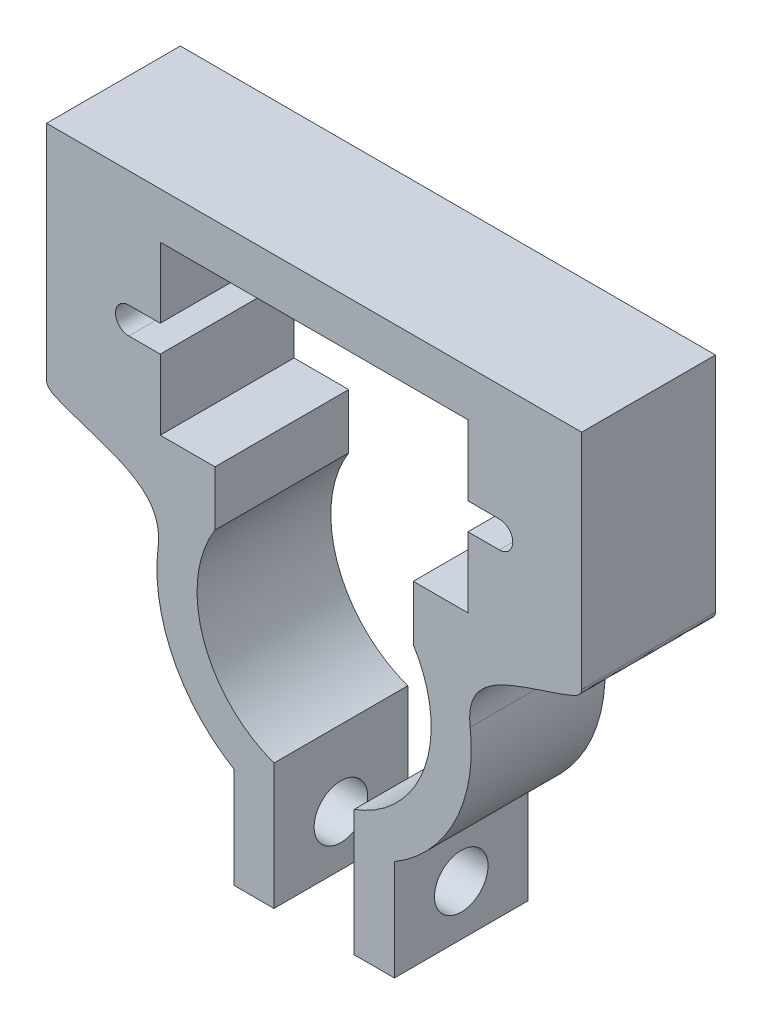
ISO-10303-21;
HEADER;
FILE_DESCRIPTION(('STEP AP214'),'2;1');
FILE_NAME('part.step','',(''),(''),'','','');
FILE_SCHEMA(('AUTOMOTIVE_DESIGN { 1 0 10303 214 1 1 1 1 }'));
ENDSEC;
DATA;
#1=APPLICATION_CONTEXT('core data for automotive mechanical design processes');
#2=APPLICATION_PROTOCOL_DEFINITION('international standard','automotive_design',2000,#1);
#3=PRODUCT_CONTEXT('',#1,'mechanical');
#4=PRODUCT('Part','Part','',(#3));
#5=PRODUCT_RELATED_PRODUCT_CATEGORY('part','',(#4));
#6=PRODUCT_DEFINITION_FORMATION('','',#4);
#7=PRODUCT_DEFINITION_CONTEXT('part definition',#1,'design');
#8=PRODUCT_DEFINITION('design','',#6,#7);
#9=PRODUCT_DEFINITION_SHAPE('','',#8);
#10=(LENGTH_UNIT() NAMED_UNIT(*) SI_UNIT(.MILLI.,.METRE.));
#11=(NAMED_UNIT(*) PLANE_ANGLE_UNIT() SI_UNIT($,.RADIAN.));
#12=(NAMED_UNIT(*) SI_UNIT($,.STERADIAN.) SOLID_ANGLE_UNIT());
#13=UNCERTAINTY_MEASURE_WITH_UNIT(LENGTH_MEASURE(1.E-05),#10,'distance_accuracy_value','');
#14=(GEOMETRIC_REPRESENTATION_CONTEXT(3) GLOBAL_UNCERTAINTY_ASSIGNED_CONTEXT((#13)) GLOBAL_UNIT_ASSIGNED_CONTEXT((#10,
#11,#12)) REPRESENTATION_CONTEXT('',''));
#15=CARTESIAN_POINT('',(0.,0.,0.));
#16=DIRECTION('',(0.,0.,1.));
#17=DIRECTION('',(1.,0.,0.));
#18=AXIS2_PLACEMENT_3D('',#15,#16,#17);
#19=CARTESIAN_POINT('',(-11.5,21.25,10.));
#20=DIRECTION('',(-1.,0.,0.));
#21=DIRECTION('',(0.,0.,1.));
#22=AXIS2_PLACEMENT_3D('',#19,#20,#21);
#23=PLANE('',#22);
#24=DIRECTION('',(0.,1.,0.));
#25=VECTOR('',#24,1.);
#26=CARTESIAN_POINT('',(-11.5,21.25,0.));
#27=LINE('',#26,#25);
#28=CARTESIAN_POINT('',(-11.5,16.,0.));
#29=VERTEX_POINT('',#28);
#30=CARTESIAN_POINT('',(-11.5,21.25,0.));
#31=VERTEX_POINT('',#30);
#32=EDGE_CURVE('E264',#29,#31,#27,.T.);
#33=ORIENTED_EDGE('',*,*,#32,.T.);
#34=DIRECTION('',(0.,0.,-1.));
#35=VECTOR('',#34,1.);
#36=CARTESIAN_POINT('',(-11.5,21.25,10.));
#37=LINE('',#36,#35);
#38=CARTESIAN_POINT('',(-11.5,21.25,10.));
#39=VERTEX_POINT('',#38);
#40=EDGE_CURVE('E11',#39,#31,#37,.T.);
#41=ORIENTED_EDGE('',*,*,#40,.F.);
#42=DIRECTION('',(0.,1.,0.));
#43=VECTOR('',#42,1.);
#44=CARTESIAN_POINT('',(-11.5,21.25,10.));
#45=LINE('',#44,#43);
#46=CARTESIAN_POINT('',(-11.5,16.,10.));
#47=VERTEX_POINT('',#46);
#48=EDGE_CURVE('E333',#47,#39,#45,.T.);
#49=ORIENTED_EDGE('',*,*,#48,.F.);
#50=DIRECTION('',(0.,0.,-1.));
#51=VECTOR('',#50,1.);
#52=CARTESIAN_POINT('',(-11.5,16.,10.));
#53=LINE('',#52,#51);
#54=EDGE_CURVE('E260',#47,#29,#53,.T.);
#55=ORIENTED_EDGE('',*,*,#54,.T.);
#56=EDGE_LOOP('',(#33,#41,#49,#55));
#57=FACE_BOUND('',#56,.T.);
#58=ADVANCED_FACE('F35',(#57),#23,.F.);
#59=CARTESIAN_POINT('',(11.5,21.25,10.));
#60=DIRECTION('',(0.,1.,0.));
#61=DIRECTION('',(0.,0.,1.));
#62=AXIS2_PLACEMENT_3D('',#59,#60,#61);
#63=PLANE('',#62);
#64=DIRECTION('',(1.,0.,0.));
#65=VECTOR('',#64,1.);
#66=CARTESIAN_POINT('',(11.5,21.25,0.));
#67=LINE('',#66,#65);
#68=CARTESIAN_POINT('',(11.5,21.25,0.));
#69=VERTEX_POINT('',#68);
#70=EDGE_CURVE('E267',#31,#69,#67,.T.);
#71=ORIENTED_EDGE('',*,*,#70,.T.);
#72=DIRECTION('',(0.,0.,-1.));
#73=VECTOR('',#72,1.);
#74=CARTESIAN_POINT('',(11.5,21.25,10.));
#75=LINE('',#74,#73);
#76=CARTESIAN_POINT('',(11.5,21.25,10.));
#77=VERTEX_POINT('',#76);
#78=EDGE_CURVE('E44',#77,#69,#75,.T.);
#79=ORIENTED_EDGE('',*,*,#78,.F.);
#80=DIRECTION('',(1.,0.,0.));
#81=VECTOR('',#80,1.);
#82=CARTESIAN_POINT('',(11.5,21.25,10.));
#83=LINE('',#82,#81);
#84=EDGE_CURVE('E161',#39,#77,#83,.T.);
#85=ORIENTED_EDGE('',*,*,#84,.F.);
#86=ORIENTED_EDGE('',*,*,#40,.T.);
#87=EDGE_LOOP('',(#71,#79,#85,#86));
#88=FACE_BOUND('',#87,.T.);
#89=ADVANCED_FACE('F514',(#88),#63,.F.);
#90=CARTESIAN_POINT('',(11.5,21.25,10.));
#91=DIRECTION('',(1.,0.,0.));
#92=DIRECTION('',(0.,0.,-1.));
#93=AXIS2_PLACEMENT_3D('',#90,#91,#92);
#94=PLANE('',#93);
#95=DIRECTION('',(0.,-1.,0.));
#96=VECTOR('',#95,1.);
#97=CARTESIAN_POINT('',(11.5,21.25,0.));
#98=LINE('',#97,#96);
#99=CARTESIAN_POINT('',(11.5,16.,0.));
#100=VERTEX_POINT('',#99);
#101=EDGE_CURVE('E270',#69,#100,#98,.T.);
#102=ORIENTED_EDGE('',*,*,#101,.T.);
#103=DIRECTION('',(0.,0.,-1.));
#104=VECTOR('',#103,1.);
#105=CARTESIAN_POINT('',(11.5,16.,10.));
#106=LINE('',#105,#104);
#107=CARTESIAN_POINT('',(11.5,16.,10.));
#108=VERTEX_POINT('',#107);
#109=EDGE_CURVE('E406',#108,#100,#106,.T.);
#110=ORIENTED_EDGE('',*,*,#109,.F.);
#111=DIRECTION('',(0.,-1.,0.));
#112=VECTOR('',#111,1.);
#113=CARTESIAN_POINT('',(11.5,21.25,10.));
#114=LINE('',#113,#112);
#115=EDGE_CURVE('E415',#77,#108,#114,.T.);
#116=ORIENTED_EDGE('',*,*,#115,.F.);
#117=ORIENTED_EDGE('',*,*,#78,.T.);
#118=EDGE_LOOP('',(#102,#110,#116,#117));
#119=FACE_BOUND('',#118,.T.);
#120=ADVANCED_FACE('F413',(#119),#94,.F.);
#121=CARTESIAN_POINT('',(13.85,16.,10.));
#122=DIRECTION('',(0.,1.,0.));
#123=DIRECTION('',(0.,0.,1.));
#124=AXIS2_PLACEMENT_3D('',#121,#122,#123);
#125=PLANE('',#124);
#126=DIRECTION('',(1.,0.,0.));
#127=VECTOR('',#126,1.);
#128=CARTESIAN_POINT('',(13.85,16.,0.));
#129=LINE('',#128,#127);
#130=CARTESIAN_POINT('',(13.85,16.,0.));
#131=VERTEX_POINT('',#130);
#132=EDGE_CURVE('E272',#100,#131,#129,.T.);
#133=ORIENTED_EDGE('',*,*,#132,.T.);
#134=DIRECTION('',(0.,0.,-1.));
#135=VECTOR('',#134,1.);
#136=CARTESIAN_POINT('',(13.85,16.,10.));
#137=LINE('',#136,#135);
#138=CARTESIAN_POINT('',(13.85,16.,10.));
#139=VERTEX_POINT('',#138);
#140=EDGE_CURVE('E403',#139,#131,#137,.T.);
#141=ORIENTED_EDGE('',*,*,#140,.F.);
#142=DIRECTION('',(1.,0.,0.));
#143=VECTOR('',#142,1.);
#144=CARTESIAN_POINT('',(13.85,16.,10.));
#145=LINE('',#144,#143);
#146=EDGE_CURVE('E433',#108,#139,#145,.T.);
#147=ORIENTED_EDGE('',*,*,#146,.F.);
#148=ORIENTED_EDGE('',*,*,#109,.T.);
#149=EDGE_LOOP('',(#133,#141,#147,#148));
#150=FACE_BOUND('',#149,.T.);
#151=ADVANCED_FACE('F424',(#150),#125,.F.);
#152=CARTESIAN_POINT('',(13.85,15.,10.));
#153=DIRECTION('',(0.,0.,-1.));
#154=DIRECTION('',(-1.,0.,0.));
#155=AXIS2_PLACEMENT_3D('',#152,#153,#154);
#156=CYLINDRICAL_SURFACE('',#155,1.);
#157=CARTESIAN_POINT('',(13.85,15.,0.));
#158=DIRECTION('',(0.,0.,-1.));
#159=DIRECTION('',(-1.,0.,0.));
#160=AXIS2_PLACEMENT_3D('',#157,#158,#159);
#161=CIRCLE('',#160,1.);
#162=CARTESIAN_POINT('',(13.85,14.,0.));
#163=VERTEX_POINT('',#162);
#164=EDGE_CURVE('E274',#131,#163,#161,.T.);
#165=ORIENTED_EDGE('',*,*,#164,.T.);
#166=DIRECTION('',(0.,0.,-1.));
#167=VECTOR('',#166,1.);
#168=CARTESIAN_POINT('',(13.85,14.,10.));
#169=LINE('',#168,#167);
#170=CARTESIAN_POINT('',(13.85,14.,10.));
#171=VERTEX_POINT('',#170);
#172=EDGE_CURVE('E400',#171,#163,#169,.T.);
#173=ORIENTED_EDGE('',*,*,#172,.F.);
#174=CARTESIAN_POINT('',(13.85,15.,10.));
#175=DIRECTION('',(0.,0.,-1.));
#176=DIRECTION('',(-1.,0.,0.));
#177=AXIS2_PLACEMENT_3D('',#174,#175,#176);
#178=CIRCLE('',#177,1.);
#179=EDGE_CURVE('E430',#139,#171,#178,.T.);
#180=ORIENTED_EDGE('',*,*,#179,.F.);
#181=ORIENTED_EDGE('',*,*,#140,.T.);
#182=EDGE_LOOP('',(#165,#173,#180,#181));
#183=FACE_BOUND('',#182,.T.);
#184=ADVANCED_FACE('F428',(#183),#156,.F.);
#185=CARTESIAN_POINT('',(13.85,14.,10.));
#186=DIRECTION('',(0.,-1.,0.));
#187=DIRECTION('',(0.,0.,-1.));
#188=AXIS2_PLACEMENT_3D('',#185,#186,#187);
#189=PLANE('',#188);
#190=DIRECTION('',(-1.,0.,0.));
#191=VECTOR('',#190,1.);
#192=CARTESIAN_POINT('',(13.85,14.,0.));
#193=LINE('',#192,#191);
#194=CARTESIAN_POINT('',(11.5,14.,0.));
#195=VERTEX_POINT('',#194);
#196=EDGE_CURVE('E276',#163,#195,#193,.T.);
#197=ORIENTED_EDGE('',*,*,#196,.T.);
#198=DIRECTION('',(0.,0.,-1.));
#199=VECTOR('',#198,1.);
#200=CARTESIAN_POINT('',(11.5,14.,10.));
#201=LINE('',#200,#199);
#202=CARTESIAN_POINT('',(11.5,14.,10.));
#203=VERTEX_POINT('',#202);
#204=EDGE_CURVE('E397',#203,#195,#201,.T.);
#205=ORIENTED_EDGE('',*,*,#204,.F.);
#206=DIRECTION('',(-1.,0.,0.));
#207=VECTOR('',#206,1.);
#208=CARTESIAN_POINT('',(13.85,14.,10.));
#209=LINE('',#208,#207);
#210=EDGE_CURVE('E432',#171,#203,#209,.T.);
#211=ORIENTED_EDGE('',*,*,#210,.F.);
#212=ORIENTED_EDGE('',*,*,#172,.T.);
#213=EDGE_LOOP('',(#197,#205,#211,#212));
#214=FACE_BOUND('',#213,.T.);
#215=ADVANCED_FACE('F504',(#214),#189,.F.);
#216=CARTESIAN_POINT('',(11.5,14.,10.));
#217=DIRECTION('',(1.,0.,0.));
#218=DIRECTION('',(0.,0.,-1.));
#219=AXIS2_PLACEMENT_3D('',#216,#217,#218);
#220=PLANE('',#219);
#221=DIRECTION('',(0.,-1.,0.));
#222=VECTOR('',#221,1.);
#223=CARTESIAN_POINT('',(11.5,14.,0.));
#224=LINE('',#223,#222);
#225=CARTESIAN_POINT('',(11.5,8.75,0.));
#226=VERTEX_POINT('',#225);
#227=EDGE_CURVE('E278',#195,#226,#224,.T.);
#228=ORIENTED_EDGE('',*,*,#227,.T.);
#229=DIRECTION('',(0.,0.,-1.));
#230=VECTOR('',#229,1.);
#231=CARTESIAN_POINT('',(11.5,8.75,10.));
#232=LINE('',#231,#230);
#233=CARTESIAN_POINT('',(11.5,8.75,10.));
#234=VERTEX_POINT('',#233);
#235=EDGE_CURVE('E394',#234,#226,#232,.T.);
#236=ORIENTED_EDGE('',*,*,#235,.F.);
#237=DIRECTION('',(0.,-1.,0.));
#238=VECTOR('',#237,1.);
#239=CARTESIAN_POINT('',(11.5,14.,10.));
#240=LINE('',#239,#238);
#241=EDGE_CURVE('E435',#203,#234,#240,.T.);
#242=ORIENTED_EDGE('',*,*,#241,.F.);
#243=ORIENTED_EDGE('',*,*,#204,.T.);
#244=EDGE_LOOP('',(#228,#236,#242,#243));
#245=FACE_BOUND('',#244,.T.);
#246=ADVANCED_FACE('F500',(#245),#220,.F.);
#247=CARTESIAN_POINT('',(11.5,8.75,10.));
#248=DIRECTION('',(0.,-1.,0.));
#249=DIRECTION('',(0.,0.,-1.));
#250=AXIS2_PLACEMENT_3D('',#247,#248,#249);
#251=PLANE('',#250);
#252=DIRECTION('',(-1.,0.,0.));
#253=VECTOR('',#252,1.);
#254=CARTESIAN_POINT('',(11.5,8.75,0.));
#255=LINE('',#254,#253);
#256=CARTESIAN_POINT('',(7.41110178363122,8.75,0.));
#257=VERTEX_POINT('',#256);
#258=EDGE_CURVE('E280',#226,#257,#255,.T.);
#259=ORIENTED_EDGE('',*,*,#258,.T.);
#260=DIRECTION('',(0.,0.,-1.));
#261=VECTOR('',#260,1.);
#262=CARTESIAN_POINT('',(7.41110178363122,8.75,10.));
#263=LINE('',#262,#261);
#264=CARTESIAN_POINT('',(7.41110178363122,8.75,10.));
#265=VERTEX_POINT('',#264);
#266=EDGE_CURVE('E391',#265,#257,#263,.T.);
#267=ORIENTED_EDGE('',*,*,#266,.F.);
#268=DIRECTION('',(-1.,0.,0.));
#269=VECTOR('',#268,1.);
#270=CARTESIAN_POINT('',(11.5,8.75,10.));
#271=LINE('',#270,#269);
#272=EDGE_CURVE('E441',#234,#265,#271,.T.);
#273=ORIENTED_EDGE('',*,*,#272,.F.);
#274=ORIENTED_EDGE('',*,*,#235,.T.);
#275=EDGE_LOOP('',(#259,#267,#273,#274));
#276=FACE_BOUND('',#275,.T.);
#277=ADVANCED_FACE('F496',(#276),#251,.F.);
#278=CARTESIAN_POINT('',(7.41110178363122,8.75,10.));
#279=DIRECTION('',(1.,0.,0.));
#280=DIRECTION('',(0.,0.,-1.));
#281=AXIS2_PLACEMENT_3D('',#278,#279,#280);
#282=PLANE('',#281);
#283=DIRECTION('',(0.,-1.,0.));
#284=VECTOR('',#283,1.);
#285=CARTESIAN_POINT('',(7.41110178363122,8.75,0.));
#286=LINE('',#285,#284);
#287=CARTESIAN_POINT('',(7.41110178363122,4.65167393017376,0.));
#288=VERTEX_POINT('',#287);
#289=EDGE_CURVE('E282',#257,#288,#286,.T.);
#290=ORIENTED_EDGE('',*,*,#289,.T.);
#291=DIRECTION('',(0.,0.,-1.));
#292=VECTOR('',#291,1.);
#293=CARTESIAN_POINT('',(7.41110178363122,4.65167393017376,10.));
#294=LINE('',#293,#292);
#295=CARTESIAN_POINT('',(7.41110178363122,4.65167393017376,10.));
#296=VERTEX_POINT('',#295);
#297=EDGE_CURVE('E388',#296,#288,#294,.T.);
#298=ORIENTED_EDGE('',*,*,#297,.F.);
#299=DIRECTION('',(0.,-1.,0.));
#300=VECTOR('',#299,1.);
#301=CARTESIAN_POINT('',(7.41110178363122,8.75,10.));
#302=LINE('',#301,#300);
#303=EDGE_CURVE('E443',#265,#296,#302,.T.);
#304=ORIENTED_EDGE('',*,*,#303,.F.);
#305=ORIENTED_EDGE('',*,*,#266,.T.);
#306=EDGE_LOOP('',(#290,#298,#304,#305));
#307=FACE_BOUND('',#306,.T.);
#308=ADVANCED_FACE('F492',(#307),#282,.F.);
#309=CARTESIAN_POINT('',(0.,0.,10.));
#310=DIRECTION('',(0.,0.,-1.));
#311=DIRECTION('',(-1.,0.,0.));
#312=AXIS2_PLACEMENT_3D('',#309,#310,#311);
#313=CYLINDRICAL_SURFACE('',#312,8.75);
#314=CARTESIAN_POINT('',(0.,0.,0.));
#315=DIRECTION('',(0.,0.,-1.));
#316=DIRECTION('',(1.,0.,0.));
#317=AXIS2_PLACEMENT_3D('',#314,#315,#316);
#318=CIRCLE('',#317,8.75);
#319=CARTESIAN_POINT('',(3.,-8.2196411113868,0.));
#320=VERTEX_POINT('',#319);
#321=EDGE_CURVE('E284',#288,#320,#318,.T.);
#322=ORIENTED_EDGE('',*,*,#321,.T.);
#323=DIRECTION('',(0.,0.,-1.));
#324=VECTOR('',#323,1.);
#325=CARTESIAN_POINT('',(3.,-8.2196411113868,10.));
#326=LINE('',#325,#324);
#327=CARTESIAN_POINT('',(3.,-8.2196411113868,10.));
#328=VERTEX_POINT('',#327);
#329=EDGE_CURVE('E385',#328,#320,#326,.T.);
#330=ORIENTED_EDGE('',*,*,#329,.F.);
#331=CARTESIAN_POINT('',(0.,0.,10.));
#332=DIRECTION('',(0.,0.,-1.));
#333=DIRECTION('',(1.,0.,0.));
#334=AXIS2_PLACEMENT_3D('',#331,#332,#333);
#335=CIRCLE('',#334,8.75);
#336=EDGE_CURVE('E445',#296,#328,#335,.T.);
#337=ORIENTED_EDGE('',*,*,#336,.F.);
#338=ORIENTED_EDGE('',*,*,#297,.T.);
#339=EDGE_LOOP('',(#322,#330,#337,#338));
#340=FACE_BOUND('',#339,.T.);
#341=ADVANCED_FACE('F488',(#340),#313,.F.);
#342=CARTESIAN_POINT('',(3.,-17.6369966719299,10.));
#343=DIRECTION('',(1.,0.,0.));
#344=DIRECTION('',(0.,0.,-1.));
#345=AXIS2_PLACEMENT_3D('',#342,#343,#344);
#346=PLANE('',#345);
#347=CARTESIAN_POINT('',(3.,-13.8697976737591,5.));
#348=DIRECTION('',(1.,0.,0.));
#349=DIRECTION('',(0.,0.,-1.));
#350=AXIS2_PLACEMENT_3D('',#347,#348,#349);
#351=CIRCLE('',#350,2.);
#352=CARTESIAN_POINT('',(3.,-13.8697976737591,3.));
#353=VERTEX_POINT('',#352);
#354=EDGE_CURVE('E268',#353,#353,#351,.T.);
#355=ORIENTED_EDGE('',*,*,#354,.T.);
#356=EDGE_LOOP('',(#355));
#357=FACE_BOUND('',#356,.T.);
#358=DIRECTION('',(0.,-1.,0.));
#359=VECTOR('',#358,1.);
#360=CARTESIAN_POINT('',(3.,-17.6369966719299,0.));
#361=LINE('',#360,#359);
#362=CARTESIAN_POINT('',(3.,-17.6369966719299,0.));
#363=VERTEX_POINT('',#362);
#364=EDGE_CURVE('E286',#320,#363,#361,.T.);
#365=ORIENTED_EDGE('',*,*,#364,.T.);
#366=DIRECTION('',(0.,0.,-1.));
#367=VECTOR('',#366,1.);
#368=CARTESIAN_POINT('',(3.,-17.6369966719299,10.));
#369=LINE('',#368,#367);
#370=CARTESIAN_POINT('',(3.,-17.6369966719299,10.));
#371=VERTEX_POINT('',#370);
#372=EDGE_CURVE('E382',#371,#363,#369,.T.);
#373=ORIENTED_EDGE('',*,*,#372,.F.);
#374=DIRECTION('',(0.,-1.,0.));
#375=VECTOR('',#374,1.);
#376=CARTESIAN_POINT('',(3.,-17.6369966719299,10.));
#377=LINE('',#376,#375);
#378=EDGE_CURVE('E447',#328,#371,#377,.T.);
#379=ORIENTED_EDGE('',*,*,#378,.F.);
#380=ORIENTED_EDGE('',*,*,#329,.T.);
#381=EDGE_LOOP('',(#365,#373,#379,#380));
#382=FACE_BOUND('',#381,.T.);
#383=ADVANCED_FACE('F484',(#357,#382),#346,.F.);
#384=CARTESIAN_POINT('',(6.,-17.6369966719299,10.));
#385=DIRECTION('',(0.,1.,0.));
#386=DIRECTION('',(0.,0.,1.));
#387=AXIS2_PLACEMENT_3D('',#384,#385,#386);
#388=PLANE('',#387);
#389=DIRECTION('',(1.,0.,0.));
#390=VECTOR('',#389,1.);
#391=CARTESIAN_POINT('',(6.,-17.6369966719299,0.));
#392=LINE('',#391,#390);
#393=CARTESIAN_POINT('',(6.,-17.6369966719299,0.));
#394=VERTEX_POINT('',#393);
#395=EDGE_CURVE('E288',#363,#394,#392,.T.);
#396=ORIENTED_EDGE('',*,*,#395,.T.);
#397=DIRECTION('',(0.,0.,-1.));
#398=VECTOR('',#397,1.);
#399=CARTESIAN_POINT('',(6.,-17.6369966719299,10.));
#400=LINE('',#399,#398);
#401=CARTESIAN_POINT('',(6.,-17.6369966719299,10.));
#402=VERTEX_POINT('',#401);
#403=EDGE_CURVE('E379',#402,#394,#400,.T.);
#404=ORIENTED_EDGE('',*,*,#403,.F.);
#405=DIRECTION('',(1.,0.,0.));
#406=VECTOR('',#405,1.);
#407=CARTESIAN_POINT('',(6.,-17.6369966719299,10.));
#408=LINE('',#407,#406);
#409=EDGE_CURVE('E449',#371,#402,#408,.T.);
#410=ORIENTED_EDGE('',*,*,#409,.F.);
#411=ORIENTED_EDGE('',*,*,#372,.T.);
#412=EDGE_LOOP('',(#396,#404,#410,#411));
#413=FACE_BOUND('',#412,.T.);
#414=ADVANCED_FACE('F480',(#413),#388,.F.);
#415=CARTESIAN_POINT('',(6.,-10.1025986755884,10.));
#416=DIRECTION('',(-1.,0.,0.));
#417=DIRECTION('',(0.,-1.,0.));
#418=AXIS2_PLACEMENT_3D('',#415,#416,#417);
#419=PLANE('',#418);
#420=CARTESIAN_POINT('',(6.,-13.8697976737591,5.));
#421=DIRECTION('',(-1.,0.,0.));
#422=DIRECTION('',(0.,-1.,0.));
#423=AXIS2_PLACEMENT_3D('',#420,#421,#422);
#424=CIRCLE('',#423,2.);
#425=CARTESIAN_POINT('',(6.,-15.8697976737591,5.));
#426=VERTEX_POINT('',#425);
#427=EDGE_CURVE('E876',#426,#426,#424,.T.);
#428=ORIENTED_EDGE('',*,*,#427,.T.);
#429=EDGE_LOOP('',(#428));
#430=FACE_BOUND('',#429,.T.);
#431=DIRECTION('',(0.,1.,0.));
#432=VECTOR('',#431,1.);
#433=CARTESIAN_POINT('',(6.,-10.1025986755884,0.));
#434=LINE('',#433,#432);
#435=CARTESIAN_POINT('',(6.,-10.1025986755884,0.));
#436=VERTEX_POINT('',#435);
#437=EDGE_CURVE('E290',#394,#436,#434,.T.);
#438=ORIENTED_EDGE('',*,*,#437,.T.);
#439=DIRECTION('',(0.,0.,-1.));
#440=VECTOR('',#439,1.);
#441=CARTESIAN_POINT('',(6.,-10.1025986755884,10.));
#442=LINE('',#441,#440);
#443=CARTESIAN_POINT('',(6.,-10.1025986755884,10.));
#444=VERTEX_POINT('',#443);
#445=EDGE_CURVE('E376',#444,#436,#442,.T.);
#446=ORIENTED_EDGE('',*,*,#445,.F.);
#447=DIRECTION('',(0.,1.,0.));
#448=VECTOR('',#447,1.);
#449=CARTESIAN_POINT('',(6.,-10.1025986755884,10.));
#450=LINE('',#449,#448);
#451=EDGE_CURVE('E451',#402,#444,#450,.T.);
#452=ORIENTED_EDGE('',*,*,#451,.F.);
#453=ORIENTED_EDGE('',*,*,#403,.T.);
#454=EDGE_LOOP('',(#438,#446,#452,#453));
#455=FACE_BOUND('',#454,.T.);
#456=ADVANCED_FACE('F476',(#430,#455),#419,.F.);
#457=CARTESIAN_POINT('',(0.,0.,10.));
#458=DIRECTION('',(0.,0.,-1.));
#459=DIRECTION('',(-1.,0.,0.));
#460=AXIS2_PLACEMENT_3D('',#457,#458,#459);
#461=CYLINDRICAL_SURFACE('',#460,11.75);
#462=CARTESIAN_POINT('',(0.,0.,0.));
#463=DIRECTION('',(0.,0.,1.));
#464=DIRECTION('',(1.,0.,0.));
#465=AXIS2_PLACEMENT_3D('',#462,#463,#464);
#466=CIRCLE('',#465,11.75);
#467=CARTESIAN_POINT('',(11.6627975173649,1.42886460833315,0.));
#468=VERTEX_POINT('',#467);
#469=EDGE_CURVE('E292',#436,#468,#466,.T.);
#470=ORIENTED_EDGE('',*,*,#469,.T.);
#471=DIRECTION('',(0.,0.,-1.));
#472=VECTOR('',#471,1.);
#473=CARTESIAN_POINT('',(11.6627975173649,1.42886460833315,10.));
#474=LINE('',#473,#472);
#475=CARTESIAN_POINT('',(11.6627975173649,1.42886460833315,10.));
#476=VERTEX_POINT('',#475);
#477=EDGE_CURVE('E373',#476,#468,#474,.T.);
#478=ORIENTED_EDGE('',*,*,#477,.F.);
#479=CARTESIAN_POINT('',(0.,0.,10.));
#480=DIRECTION('',(0.,0.,1.));
#481=DIRECTION('',(1.,0.,0.));
#482=AXIS2_PLACEMENT_3D('',#479,#480,#481);
#483=CIRCLE('',#482,11.75);
#484=EDGE_CURVE('E453',#444,#476,#483,.T.);
#485=ORIENTED_EDGE('',*,*,#484,.F.);
#486=ORIENTED_EDGE('',*,*,#445,.T.);
#487=EDGE_LOOP('',(#470,#478,#485,#486));
#488=FACE_BOUND('',#487,.T.);
#489=ADVANCED_FACE('F471',(#488),#461,.T.);
#490=CARTESIAN_POINT('',(11.6627975173649,1.42886460833315,10.));
#491=CARTESIAN_POINT('',(11.1932723778448,5.26126174351275,10.));
#492=CARTESIAN_POINT('',(15.9235162685424,5.84685358203671,10.));
#493=CARTESIAN_POINT('',(20.,7.58340465944013,10.));
#494=CARTESIAN_POINT('',(20.,8.04953051071342,10.));
#495=B_SPLINE_CURVE_WITH_KNOTS('',3,(#490,#491,#492,#493,#494),.UNSPECIFIED.,.F.,.F.,(4,1,4),
(0.,0.86381438470754,1.),.UNSPECIFIED.);
#496=DIRECTION('',(0.,0.,-1.));
#497=VECTOR('',#496,1.);
#498=SURFACE_OF_LINEAR_EXTRUSION('',#495,#497);
#499=CARTESIAN_POINT('',(11.6627975173649,1.42886460833315,0.));
#500=CARTESIAN_POINT('',(11.1932723778448,5.26126174351275,0.));
#501=CARTESIAN_POINT('',(15.9235162685424,5.84685358203671,0.));
#502=CARTESIAN_POINT('',(20.,7.58340465944013,0.));
#503=CARTESIAN_POINT('',(20.,8.04953051071342,0.));
#504=B_SPLINE_CURVE_WITH_KNOTS('',3,(#499,#500,#501,#502,#503),.UNSPECIFIED.,.F.,.F.,(4,1,4),
(0.,0.86381438470754,1.),.UNSPECIFIED.);
#505=CARTESIAN_POINT('',(20.,8.04953051071342,0.));
#506=VERTEX_POINT('',#505);
#507=EDGE_CURVE('E294',#468,#506,#504,.T.);
#508=ORIENTED_EDGE('',*,*,#507,.T.);
#509=DIRECTION('',(0.,0.,-1.));
#510=VECTOR('',#509,1.);
#511=CARTESIAN_POINT('',(20.,8.04953051071342,10.));
#512=LINE('',#511,#510);
#513=CARTESIAN_POINT('',(20.,8.04953051071342,10.));
#514=VERTEX_POINT('',#513);
#515=EDGE_CURVE('E370',#514,#506,#512,.T.);
#516=ORIENTED_EDGE('',*,*,#515,.F.);
#517=EDGE_CURVE('E455',#476,#514,#495,.T.);
#518=ORIENTED_EDGE('',*,*,#517,.F.);
#519=ORIENTED_EDGE('',*,*,#477,.T.);
#520=EDGE_LOOP('',(#508,#516,#518,#519));
#521=FACE_BOUND('',#520,.T.);
#522=ADVANCED_FACE('F466',(#521),#498,.F.);
#523=CARTESIAN_POINT('',(20.,8.04953051071342,10.));
#524=DIRECTION('',(-1.,0.,0.));
#525=DIRECTION('',(0.,0.,1.));
#526=AXIS2_PLACEMENT_3D('',#523,#524,#525);
#527=PLANE('',#526);
#528=DIRECTION('',(0.,1.,0.));
#529=VECTOR('',#528,1.);
#530=CARTESIAN_POINT('',(20.,8.04953051071342,0.));
#531=LINE('',#530,#529);
#532=CARTESIAN_POINT('',(20.,24.6968623881826,0.));
#533=VERTEX_POINT('',#532);
#534=EDGE_CURVE('E298',#506,#533,#531,.T.);
#535=ORIENTED_EDGE('',*,*,#534,.T.);
#536=DIRECTION('',(0.,0.,-1.));
#537=VECTOR('',#536,1.);
#538=CARTESIAN_POINT('',(20.,24.6968623881826,10.));
#539=LINE('',#538,#537);
#540=CARTESIAN_POINT('',(20.,24.6968623881826,10.));
#541=VERTEX_POINT('',#540);
#542=EDGE_CURVE('E367',#541,#533,#539,.T.);
#543=ORIENTED_EDGE('',*,*,#542,.F.);
#544=DIRECTION('',(0.,1.,0.));
#545=VECTOR('',#544,1.);
#546=CARTESIAN_POINT('',(20.,8.04953051071342,10.));
#547=LINE('',#546,#545);
#548=EDGE_CURVE('E460',#514,#541,#547,.T.);
#549=ORIENTED_EDGE('',*,*,#548,.F.);
#550=ORIENTED_EDGE('',*,*,#515,.T.);
#551=EDGE_LOOP('',(#535,#543,#549,#550));
#552=FACE_BOUND('',#551,.T.);
#553=ADVANCED_FACE('F470',(#552),#527,.F.);
#554=CARTESIAN_POINT('',(-20.,24.6968623881826,10.));
#555=DIRECTION('',(0.,-1.,0.));
#556=DIRECTION('',(0.,0.,-1.));
#557=AXIS2_PLACEMENT_3D('',#554,#555,#556);
#558=PLANE('',#557);
#559=DIRECTION('',(-1.,0.,0.));
#560=VECTOR('',#559,1.);
#561=CARTESIAN_POINT('',(-20.,24.6968623881826,0.));
#562=LINE('',#561,#560);
#563=CARTESIAN_POINT('',(-20.,24.6968623881826,0.));
#564=VERTEX_POINT('',#563);
#565=EDGE_CURVE('E303',#533,#564,#562,.T.);
#566=ORIENTED_EDGE('',*,*,#565,.T.);
#567=DIRECTION('',(0.,0.,-1.));
#568=VECTOR('',#567,1.);
#569=CARTESIAN_POINT('',(-20.,24.6968623881826,10.));
#570=LINE('',#569,#568);
#571=CARTESIAN_POINT('',(-20.,24.6968623881826,10.));
#572=VERTEX_POINT('',#571);
#573=EDGE_CURVE('E364',#572,#564,#570,.T.);
#574=ORIENTED_EDGE('',*,*,#573,.F.);
#575=DIRECTION('',(-1.,0.,0.));
#576=VECTOR('',#575,1.);
#577=CARTESIAN_POINT('',(-20.,24.6968623881826,10.));
#578=LINE('',#577,#576);
#579=EDGE_CURVE('E585',#541,#572,#578,.T.);
#580=ORIENTED_EDGE('',*,*,#579,.F.);
#581=ORIENTED_EDGE('',*,*,#542,.T.);
#582=EDGE_LOOP('',(#566,#574,#580,#581));
#583=FACE_BOUND('',#582,.T.);
#584=ADVANCED_FACE('F584',(#583),#558,.F.);
#585=CARTESIAN_POINT('',(-20.,8.04953051071342,10.));
#586=DIRECTION('',(1.,0.,0.));
#587=DIRECTION('',(0.,0.,-1.));
#588=AXIS2_PLACEMENT_3D('',#585,#586,#587);
#589=PLANE('',#588);
#590=DIRECTION('',(0.,-1.,0.));
#591=VECTOR('',#590,1.);
#592=CARTESIAN_POINT('',(-20.,8.04953051071342,0.));
#593=LINE('',#592,#591);
#594=CARTESIAN_POINT('',(-20.,8.04953051071342,0.));
#595=VERTEX_POINT('',#594);
#596=EDGE_CURVE('E305',#564,#595,#593,.T.);
#597=ORIENTED_EDGE('',*,*,#596,.T.);
#598=DIRECTION('',(0.,0.,-1.));
#599=VECTOR('',#598,1.);
#600=CARTESIAN_POINT('',(-20.,8.04953051071342,10.));
#601=LINE('',#600,#599);
#602=CARTESIAN_POINT('',(-20.,8.04953051071342,10.));
#603=VERTEX_POINT('',#602);
#604=EDGE_CURVE('E361',#603,#595,#601,.T.);
#605=ORIENTED_EDGE('',*,*,#604,.F.);
#606=DIRECTION('',(0.,-1.,0.));
#607=VECTOR('',#606,1.);
#608=CARTESIAN_POINT('',(-20.,8.04953051071342,10.));
#609=LINE('',#608,#607);
#610=EDGE_CURVE('E581',#572,#603,#609,.T.);
#611=ORIENTED_EDGE('',*,*,#610,.F.);
#612=ORIENTED_EDGE('',*,*,#573,.T.);
#613=EDGE_LOOP('',(#597,#605,#611,#612));
#614=FACE_BOUND('',#613,.T.);
#615=ADVANCED_FACE('F578',(#614),#589,.F.);
#616=CARTESIAN_POINT('',(-20.,8.04953051071342,10.));
#617=CARTESIAN_POINT('',(-20.,7.58340465944013,10.));
#618=CARTESIAN_POINT('',(-15.9235162685424,5.84685358203671,10.));
#619=CARTESIAN_POINT('',(-11.1932723778448,5.26126174351274,10.));
#620=CARTESIAN_POINT('',(-11.6627975173649,1.42886460833315,10.));
#621=B_SPLINE_CURVE_WITH_KNOTS('',3,(#616,#617,#618,#619,#620),.UNSPECIFIED.,.F.,.F.,(4,1,4),
(0.,0.13618561529246,1.),.UNSPECIFIED.);
#622=DIRECTION('',(0.,0.,-1.));
#623=VECTOR('',#622,1.);
#624=SURFACE_OF_LINEAR_EXTRUSION('',#621,#623);
#625=CARTESIAN_POINT('',(-20.,8.04953051071342,0.));
#626=CARTESIAN_POINT('',(-20.,7.58340465944013,0.));
#627=CARTESIAN_POINT('',(-15.9235162685424,5.84685358203671,0.));
#628=CARTESIAN_POINT('',(-11.1932723778448,5.26126174351274,0.));
#629=CARTESIAN_POINT('',(-11.6627975173649,1.42886460833315,0.));
#630=B_SPLINE_CURVE_WITH_KNOTS('',3,(#625,#626,#627,#628,#629),.UNSPECIFIED.,.F.,.F.,(4,1,4),
(0.,0.13618561529246,1.),.UNSPECIFIED.);
#631=CARTESIAN_POINT('',(-11.6627975173649,1.42886460833315,0.));
#632=VERTEX_POINT('',#631);
#633=EDGE_CURVE('E307',#595,#632,#630,.T.);
#634=ORIENTED_EDGE('',*,*,#633,.T.);
#635=DIRECTION('',(0.,0.,-1.));
#636=VECTOR('',#635,1.);
#637=CARTESIAN_POINT('',(-11.6627975173649,1.42886460833315,10.));
#638=LINE('',#637,#636);
#639=CARTESIAN_POINT('',(-11.6627975173649,1.42886460833315,10.));
#640=VERTEX_POINT('',#639);
#641=EDGE_CURVE('E358',#640,#632,#638,.T.);
#642=ORIENTED_EDGE('',*,*,#641,.F.);
#643=EDGE_CURVE('E572',#603,#640,#621,.T.);
#644=ORIENTED_EDGE('',*,*,#643,.F.);
#645=ORIENTED_EDGE('',*,*,#604,.T.);
#646=EDGE_LOOP('',(#634,#642,#644,#645));
#647=FACE_BOUND('',#646,.T.);
#648=ADVANCED_FACE('F571',(#647),#624,.F.);
#649=CARTESIAN_POINT('',(0.,0.,10.));
#650=DIRECTION('',(0.,0.,-1.));
#651=DIRECTION('',(-1.,0.,0.));
#652=AXIS2_PLACEMENT_3D('',#649,#650,#651);
#653=CYLINDRICAL_SURFACE('',#652,11.75);
#654=CARTESIAN_POINT('',(0.,0.,0.));
#655=DIRECTION('',(0.,0.,1.));
#656=DIRECTION('',(-1.,0.,0.));
#657=AXIS2_PLACEMENT_3D('',#654,#655,#656);
#658=CIRCLE('',#657,11.75);
#659=CARTESIAN_POINT('',(-6.,-10.1025986755884,0.));
#660=VERTEX_POINT('',#659);
#661=EDGE_CURVE('E311',#632,#660,#658,.T.);
#662=ORIENTED_EDGE('',*,*,#661,.T.);
#663=DIRECTION('',(0.,0.,-1.));
#664=VECTOR('',#663,1.);
#665=CARTESIAN_POINT('',(-6.,-10.1025986755884,10.));
#666=LINE('',#665,#664);
#667=CARTESIAN_POINT('',(-6.,-10.1025986755884,10.));
#668=VERTEX_POINT('',#667);
#669=EDGE_CURVE('E355',#668,#660,#666,.T.);
#670=ORIENTED_EDGE('',*,*,#669,.F.);
#671=CARTESIAN_POINT('',(0.,0.,10.));
#672=DIRECTION('',(0.,0.,1.));
#673=DIRECTION('',(-1.,0.,0.));
#674=AXIS2_PLACEMENT_3D('',#671,#672,#673);
#675=CIRCLE('',#674,11.75);
#676=EDGE_CURVE('E567',#640,#668,#675,.T.);
#677=ORIENTED_EDGE('',*,*,#676,.F.);
#678=ORIENTED_EDGE('',*,*,#641,.T.);
#679=EDGE_LOOP('',(#662,#670,#677,#678));
#680=FACE_BOUND('',#679,.T.);
#681=ADVANCED_FACE('F566',(#680),#653,.T.);
#682=CARTESIAN_POINT('',(-6.,-10.1025986755884,10.));
#683=DIRECTION('',(1.,0.,0.));
#684=DIRECTION('',(0.,1.,0.));
#685=AXIS2_PLACEMENT_3D('',#682,#683,#684);
#686=PLANE('',#685);
#687=CARTESIAN_POINT('',(-6.,-13.8697976737591,5.));
#688=DIRECTION('',(-1.,0.,0.));
#689=DIRECTION('',(0.,-1.,0.));
#690=AXIS2_PLACEMENT_3D('',#687,#688,#689);
#691=CIRCLE('',#690,2.);
#692=CARTESIAN_POINT('',(-6.,-15.8697976737591,5.));
#693=VERTEX_POINT('',#692);
#694=EDGE_CURVE('E884',#693,#693,#691,.T.);
#695=ORIENTED_EDGE('',*,*,#694,.F.);
#696=EDGE_LOOP('',(#695));
#697=FACE_BOUND('',#696,.T.);
#698=DIRECTION('',(0.,-1.,0.));
#699=VECTOR('',#698,1.);
#700=CARTESIAN_POINT('',(-6.,-10.1025986755884,0.));
#701=LINE('',#700,#699);
#702=CARTESIAN_POINT('',(-6.,-17.6369966719299,0.));
#703=VERTEX_POINT('',#702);
#704=EDGE_CURVE('E316',#660,#703,#701,.T.);
#705=ORIENTED_EDGE('',*,*,#704,.T.);
#706=DIRECTION('',(0.,0.,-1.));
#707=VECTOR('',#706,1.);
#708=CARTESIAN_POINT('',(-6.,-17.6369966719299,10.));
#709=LINE('',#708,#707);
#710=CARTESIAN_POINT('',(-6.,-17.6369966719299,10.));
#711=VERTEX_POINT('',#710);
#712=EDGE_CURVE('E352',#711,#703,#709,.T.);
#713=ORIENTED_EDGE('',*,*,#712,.F.);
#714=DIRECTION('',(0.,-1.,0.));
#715=VECTOR('',#714,1.);
#716=CARTESIAN_POINT('',(-6.,-10.1025986755884,10.));
#717=LINE('',#716,#715);
#718=EDGE_CURVE('E563',#668,#711,#717,.T.);
#719=ORIENTED_EDGE('',*,*,#718,.F.);
#720=ORIENTED_EDGE('',*,*,#669,.T.);
#721=EDGE_LOOP('',(#705,#713,#719,#720));
#722=FACE_BOUND('',#721,.T.);
#723=ADVANCED_FACE('F560',(#697,#722),#686,.F.);
#724=CARTESIAN_POINT('',(-6.,-17.6369966719299,10.));
#725=DIRECTION('',(0.,1.,0.));
#726=DIRECTION('',(0.,0.,1.));
#727=AXIS2_PLACEMENT_3D('',#724,#725,#726);
#728=PLANE('',#727);
#729=DIRECTION('',(1.,0.,0.));
#730=VECTOR('',#729,1.);
#731=CARTESIAN_POINT('',(-6.,-17.6369966719299,0.));
#732=LINE('',#731,#730);
#733=CARTESIAN_POINT('',(-3.,-17.6369966719299,0.));
#734=VERTEX_POINT('',#733);
#735=EDGE_CURVE('E318',#703,#734,#732,.T.);
#736=ORIENTED_EDGE('',*,*,#735,.T.);
#737=DIRECTION('',(0.,0.,-1.));
#738=VECTOR('',#737,1.);
#739=CARTESIAN_POINT('',(-3.,-17.6369966719299,10.));
#740=LINE('',#739,#738);
#741=CARTESIAN_POINT('',(-3.,-17.6369966719299,10.));
#742=VERTEX_POINT('',#741);
#743=EDGE_CURVE('E349',#742,#734,#740,.T.);
#744=ORIENTED_EDGE('',*,*,#743,.F.);
#745=DIRECTION('',(1.,0.,0.));
#746=VECTOR('',#745,1.);
#747=CARTESIAN_POINT('',(-6.,-17.6369966719299,10.));
#748=LINE('',#747,#746);
#749=EDGE_CURVE('E554',#711,#742,#748,.T.);
#750=ORIENTED_EDGE('',*,*,#749,.F.);
#751=ORIENTED_EDGE('',*,*,#712,.T.);
#752=EDGE_LOOP('',(#736,#744,#750,#751));
#753=FACE_BOUND('',#752,.T.);
#754=ADVANCED_FACE('F553',(#753),#728,.F.);
#755=CARTESIAN_POINT('',(-3.,-17.6369966719299,10.));
#756=DIRECTION('',(-1.,0.,0.));
#757=DIRECTION('',(0.,0.,1.));
#758=AXIS2_PLACEMENT_3D('',#755,#756,#757);
#759=PLANE('',#758);
#760=CARTESIAN_POINT('',(-3.,-13.8697976737591,5.));
#761=DIRECTION('',(-1.,0.,0.));
#762=DIRECTION('',(0.,0.,1.));
#763=AXIS2_PLACEMENT_3D('',#760,#761,#762);
#764=CIRCLE('',#763,2.);
#765=CARTESIAN_POINT('',(-3.,-13.8697976737591,7.));
#766=VERTEX_POINT('',#765);
#767=EDGE_CURVE('E38',#766,#766,#764,.T.);
#768=ORIENTED_EDGE('',*,*,#767,.T.);
#769=EDGE_LOOP('',(#768));
#770=FACE_BOUND('',#769,.T.);
#771=DIRECTION('',(0.,1.,0.));
#772=VECTOR('',#771,1.);
#773=CARTESIAN_POINT('',(-3.,-17.6369966719299,0.));
#774=LINE('',#773,#772);
#775=CARTESIAN_POINT('',(-3.,-8.2196411113868,0.));
#776=VERTEX_POINT('',#775);
#777=EDGE_CURVE('E320',#734,#776,#774,.T.);
#778=ORIENTED_EDGE('',*,*,#777,.T.);
#779=DIRECTION('',(0.,0.,-1.));
#780=VECTOR('',#779,1.);
#781=CARTESIAN_POINT('',(-3.,-8.2196411113868,10.));
#782=LINE('',#781,#780);
#783=CARTESIAN_POINT('',(-3.,-8.2196411113868,10.));
#784=VERTEX_POINT('',#783);
#785=EDGE_CURVE('E346',#784,#776,#782,.T.);
#786=ORIENTED_EDGE('',*,*,#785,.F.);
#787=DIRECTION('',(0.,1.,0.));
#788=VECTOR('',#787,1.);
#789=CARTESIAN_POINT('',(-3.,-17.6369966719299,10.));
#790=LINE('',#789,#788);
#791=EDGE_CURVE('E549',#742,#784,#790,.T.);
#792=ORIENTED_EDGE('',*,*,#791,.F.);
#793=ORIENTED_EDGE('',*,*,#743,.T.);
#794=EDGE_LOOP('',(#778,#786,#792,#793));
#795=FACE_BOUND('',#794,.T.);
#796=ADVANCED_FACE('F548',(#770,#795),#759,.F.);
#797=CARTESIAN_POINT('',(0.,0.,10.));
#798=DIRECTION('',(0.,0.,-1.));
#799=DIRECTION('',(-1.,0.,0.));
#800=AXIS2_PLACEMENT_3D('',#797,#798,#799);
#801=CYLINDRICAL_SURFACE('',#800,8.75);
#802=CARTESIAN_POINT('',(0.,0.,0.));
#803=DIRECTION('',(0.,0.,-1.));
#804=DIRECTION('',(-1.,0.,0.));
#805=AXIS2_PLACEMENT_3D('',#802,#803,#804);
#806=CIRCLE('',#805,8.75);
#807=CARTESIAN_POINT('',(-7.41110178363122,4.65167393017376,0.));
#808=VERTEX_POINT('',#807);
#809=EDGE_CURVE('E322',#776,#808,#806,.T.);
#810=ORIENTED_EDGE('',*,*,#809,.T.);
#811=DIRECTION('',(0.,0.,-1.));
#812=VECTOR('',#811,1.);
#813=CARTESIAN_POINT('',(-7.41110178363122,4.65167393017376,10.));
#814=LINE('',#813,#812);
#815=CARTESIAN_POINT('',(-7.41110178363122,4.65167393017376,10.));
#816=VERTEX_POINT('',#815);
#817=EDGE_CURVE('E343',#816,#808,#814,.T.);
#818=ORIENTED_EDGE('',*,*,#817,.F.);
#819=CARTESIAN_POINT('',(0.,0.,10.));
#820=DIRECTION('',(0.,0.,-1.));
#821=DIRECTION('',(-1.,0.,0.));
#822=AXIS2_PLACEMENT_3D('',#819,#820,#821);
#823=CIRCLE('',#822,8.75);
#824=EDGE_CURVE('E545',#784,#816,#823,.T.);
#825=ORIENTED_EDGE('',*,*,#824,.F.);
#826=ORIENTED_EDGE('',*,*,#785,.T.);
#827=EDGE_LOOP('',(#810,#818,#825,#826));
#828=FACE_BOUND('',#827,.T.);
#829=ADVANCED_FACE('F542',(#828),#801,.F.);
#830=CARTESIAN_POINT('',(-7.41110178363122,8.75,10.));
#831=DIRECTION('',(-1.,0.,0.));
#832=DIRECTION('',(0.,0.,1.));
#833=AXIS2_PLACEMENT_3D('',#830,#831,#832);
#834=PLANE('',#833);
#835=DIRECTION('',(0.,1.,0.));
#836=VECTOR('',#835,1.);
#837=CARTESIAN_POINT('',(-7.41110178363122,8.75,0.));
#838=LINE('',#837,#836);
#839=CARTESIAN_POINT('',(-7.41110178363122,8.75,0.));
#840=VERTEX_POINT('',#839);
#841=EDGE_CURVE('E324',#808,#840,#838,.T.);
#842=ORIENTED_EDGE('',*,*,#841,.T.);
#843=DIRECTION('',(0.,0.,-1.));
#844=VECTOR('',#843,1.);
#845=CARTESIAN_POINT('',(-7.41110178363122,8.75,10.));
#846=LINE('',#845,#844);
#847=CARTESIAN_POINT('',(-7.41110178363122,8.75,10.));
#848=VERTEX_POINT('',#847);
#849=EDGE_CURVE('E340',#848,#840,#846,.T.);
#850=ORIENTED_EDGE('',*,*,#849,.F.);
#851=DIRECTION('',(0.,1.,0.));
#852=VECTOR('',#851,1.);
#853=CARTESIAN_POINT('',(-7.41110178363122,8.75,10.));
#854=LINE('',#853,#852);
#855=EDGE_CURVE('E536',#816,#848,#854,.T.);
#856=ORIENTED_EDGE('',*,*,#855,.F.);
#857=ORIENTED_EDGE('',*,*,#817,.T.);
#858=EDGE_LOOP('',(#842,#850,#856,#857));
#859=FACE_BOUND('',#858,.T.);
#860=ADVANCED_FACE('F535',(#859),#834,.F.);
#861=CARTESIAN_POINT('',(-11.5,8.75,10.));
#862=DIRECTION('',(0.,-1.,0.));
#863=DIRECTION('',(0.,0.,-1.));
#864=AXIS2_PLACEMENT_3D('',#861,#862,#863);
#865=PLANE('',#864);
#866=DIRECTION('',(-1.,0.,0.));
#867=VECTOR('',#866,1.);
#868=CARTESIAN_POINT('',(-11.5,8.75,0.));
#869=LINE('',#868,#867);
#870=CARTESIAN_POINT('',(-11.5,8.75,0.));
#871=VERTEX_POINT('',#870);
#872=EDGE_CURVE('E326',#840,#871,#869,.T.);
#873=ORIENTED_EDGE('',*,*,#872,.T.);
#874=DIRECTION('',(0.,0.,-1.));
#875=VECTOR('',#874,1.);
#876=CARTESIAN_POINT('',(-11.5,8.75,10.));
#877=LINE('',#876,#875);
#878=CARTESIAN_POINT('',(-11.5,8.75,10.));
#879=VERTEX_POINT('',#878);
#880=EDGE_CURVE('E337',#879,#871,#877,.T.);
#881=ORIENTED_EDGE('',*,*,#880,.F.);
#882=DIRECTION('',(-1.,0.,0.));
#883=VECTOR('',#882,1.);
#884=CARTESIAN_POINT('',(-11.5,8.75,10.));
#885=LINE('',#884,#883);
#886=EDGE_CURVE('E531',#848,#879,#885,.T.);
#887=ORIENTED_EDGE('',*,*,#886,.F.);
#888=ORIENTED_EDGE('',*,*,#849,.T.);
#889=EDGE_LOOP('',(#873,#881,#887,#888));
#890=FACE_BOUND('',#889,.T.);
#891=ADVANCED_FACE('F530',(#890),#865,.F.);
#892=CARTESIAN_POINT('',(-11.5,14.,10.));
#893=DIRECTION('',(-1.,0.,0.));
#894=DIRECTION('',(0.,0.,1.));
#895=AXIS2_PLACEMENT_3D('',#892,#893,#894);
#896=PLANE('',#895);
#897=DIRECTION('',(0.,1.,0.));
#898=VECTOR('',#897,1.);
#899=CARTESIAN_POINT('',(-11.5,14.,0.));
#900=LINE('',#899,#898);
#901=CARTESIAN_POINT('',(-11.5,14.,0.));
#902=VERTEX_POINT('',#901);
#903=EDGE_CURVE('E328',#871,#902,#900,.T.);
#904=ORIENTED_EDGE('',*,*,#903,.T.);
#905=DIRECTION('',(0.,0.,-1.));
#906=VECTOR('',#905,1.);
#907=CARTESIAN_POINT('',(-11.5,14.,10.));
#908=LINE('',#907,#906);
#909=CARTESIAN_POINT('',(-11.5,14.,10.));
#910=VERTEX_POINT('',#909);
#911=EDGE_CURVE('E255',#910,#902,#908,.T.);
#912=ORIENTED_EDGE('',*,*,#911,.F.);
#913=DIRECTION('',(0.,1.,0.));
#914=VECTOR('',#913,1.);
#915=CARTESIAN_POINT('',(-11.5,14.,10.));
#916=LINE('',#915,#914);
#917=EDGE_CURVE('E246',#879,#910,#916,.T.);
#918=ORIENTED_EDGE('',*,*,#917,.F.);
#919=ORIENTED_EDGE('',*,*,#880,.T.);
#920=EDGE_LOOP('',(#904,#912,#918,#919));
#921=FACE_BOUND('',#920,.T.);
#922=ADVANCED_FACE('F526',(#921),#896,.F.);
#923=CARTESIAN_POINT('',(-13.85,14.,10.));
#924=DIRECTION('',(0.,-1.,0.));
#925=DIRECTION('',(0.,0.,-1.));
#926=AXIS2_PLACEMENT_3D('',#923,#924,#925);
#927=PLANE('',#926);
#928=DIRECTION('',(-1.,0.,0.));
#929=VECTOR('',#928,1.);
#930=CARTESIAN_POINT('',(-13.85,14.,0.));
#931=LINE('',#930,#929);
#932=CARTESIAN_POINT('',(-13.85,14.,0.));
#933=VERTEX_POINT('',#932);
#934=EDGE_CURVE('E254',#902,#933,#931,.T.);
#935=ORIENTED_EDGE('',*,*,#934,.T.);
#936=DIRECTION('',(0.,0.,-1.));
#937=VECTOR('',#936,1.);
#938=CARTESIAN_POINT('',(-13.85,14.,10.));
#939=LINE('',#938,#937);
#940=CARTESIAN_POINT('',(-13.85,14.,10.));
#941=VERTEX_POINT('',#940);
#942=EDGE_CURVE('E251',#941,#933,#939,.T.);
#943=ORIENTED_EDGE('',*,*,#942,.F.);
#944=DIRECTION('',(-1.,0.,0.));
#945=VECTOR('',#944,1.);
#946=CARTESIAN_POINT('',(-13.85,14.,10.));
#947=LINE('',#946,#945);
#948=EDGE_CURVE('E240',#910,#941,#947,.T.);
#949=ORIENTED_EDGE('',*,*,#948,.F.);
#950=ORIENTED_EDGE('',*,*,#911,.T.);
#951=EDGE_LOOP('',(#935,#943,#949,#950));
#952=FACE_BOUND('',#951,.T.);
#953=ADVANCED_FACE('F252',(#952),#927,.F.);
#954=CARTESIAN_POINT('',(-13.85,15.,10.));
#955=DIRECTION('',(0.,0.,-1.));
#956=DIRECTION('',(-1.,0.,0.));
#957=AXIS2_PLACEMENT_3D('',#954,#955,#956);
#958=CYLINDRICAL_SURFACE('',#957,1.);
#959=CARTESIAN_POINT('',(-13.85,15.,0.));
#960=DIRECTION('',(0.,0.,-1.));
#961=DIRECTION('',(1.,0.,0.));
#962=AXIS2_PLACEMENT_3D('',#959,#960,#961);
#963=CIRCLE('',#962,1.);
#964=CARTESIAN_POINT('',(-13.85,16.,0.));
#965=VERTEX_POINT('',#964);
#966=EDGE_CURVE('E147',#933,#965,#963,.T.);
#967=ORIENTED_EDGE('',*,*,#966,.T.);
#968=DIRECTION('',(0.,0.,-1.));
#969=VECTOR('',#968,1.);
#970=CARTESIAN_POINT('',(-13.85,16.,10.));
#971=LINE('',#970,#969);
#972=CARTESIAN_POINT('',(-13.85,16.,10.));
#973=VERTEX_POINT('',#972);
#974=EDGE_CURVE('E256',#973,#965,#971,.T.);
#975=ORIENTED_EDGE('',*,*,#974,.F.);
#976=CARTESIAN_POINT('',(-13.85,15.,10.));
#977=DIRECTION('',(0.,0.,-1.));
#978=DIRECTION('',(1.,0.,0.));
#979=AXIS2_PLACEMENT_3D('',#976,#977,#978);
#980=CIRCLE('',#979,1.);
#981=EDGE_CURVE('E244',#941,#973,#980,.T.);
#982=ORIENTED_EDGE('',*,*,#981,.F.);
#983=ORIENTED_EDGE('',*,*,#942,.T.);
#984=EDGE_LOOP('',(#967,#975,#982,#983));
#985=FACE_BOUND('',#984,.T.);
#986=ADVANCED_FACE('F258',(#985),#958,.F.);
#987=CARTESIAN_POINT('',(-13.85,16.,10.));
#988=DIRECTION('',(0.,1.,0.));
#989=DIRECTION('',(0.,0.,1.));
#990=AXIS2_PLACEMENT_3D('',#987,#988,#989);
#991=PLANE('',#990);
#992=DIRECTION('',(1.,0.,0.));
#993=VECTOR('',#992,1.);
#994=CARTESIAN_POINT('',(-13.85,16.,0.));
#995=LINE('',#994,#993);
#996=EDGE_CURVE('E153',#965,#29,#995,.T.);
#997=ORIENTED_EDGE('',*,*,#996,.T.);
#998=ORIENTED_EDGE('',*,*,#54,.F.);
#999=DIRECTION('',(1.,0.,0.));
#1000=VECTOR('',#999,1.);
#1001=CARTESIAN_POINT('',(-13.85,16.,10.));
#1002=LINE('',#1001,#1000);
#1003=EDGE_CURVE('E52',#973,#47,#1002,.T.);
#1004=ORIENTED_EDGE('',*,*,#1003,.F.);
#1005=ORIENTED_EDGE('',*,*,#974,.T.);
#1006=EDGE_LOOP('',(#997,#998,#1004,#1005));
#1007=FACE_BOUND('',#1006,.T.);
#1008=ADVANCED_FACE('F818',(#1007),#991,.F.);
#1009=CARTESIAN_POINT('',(-13.85,15.,10.));
#1010=DIRECTION('',(0.,0.,1.));
#1011=DIRECTION('',(1.,0.,0.));
#1012=AXIS2_PLACEMENT_3D('',#1009,#1010,#1011);
#1013=PLANE('',#1012);
#1014=ORIENTED_EDGE('',*,*,#48,.T.);
#1015=ORIENTED_EDGE('',*,*,#84,.T.);
#1016=ORIENTED_EDGE('',*,*,#115,.T.);
#1017=ORIENTED_EDGE('',*,*,#146,.T.);
#1018=ORIENTED_EDGE('',*,*,#179,.T.);
#1019=ORIENTED_EDGE('',*,*,#210,.T.);
#1020=ORIENTED_EDGE('',*,*,#241,.T.);
#1021=ORIENTED_EDGE('',*,*,#272,.T.);
#1022=ORIENTED_EDGE('',*,*,#303,.T.);
#1023=ORIENTED_EDGE('',*,*,#336,.T.);
#1024=ORIENTED_EDGE('',*,*,#378,.T.);
#1025=ORIENTED_EDGE('',*,*,#409,.T.);
#1026=ORIENTED_EDGE('',*,*,#451,.T.);
#1027=ORIENTED_EDGE('',*,*,#484,.T.);
#1028=ORIENTED_EDGE('',*,*,#517,.T.);
#1029=ORIENTED_EDGE('',*,*,#548,.T.);
#1030=ORIENTED_EDGE('',*,*,#579,.T.);
#1031=ORIENTED_EDGE('',*,*,#610,.T.);
#1032=ORIENTED_EDGE('',*,*,#643,.T.);
#1033=ORIENTED_EDGE('',*,*,#676,.T.);
#1034=ORIENTED_EDGE('',*,*,#718,.T.);
#1035=ORIENTED_EDGE('',*,*,#749,.T.);
#1036=ORIENTED_EDGE('',*,*,#791,.T.);
#1037=ORIENTED_EDGE('',*,*,#824,.T.);
#1038=ORIENTED_EDGE('',*,*,#855,.T.);
#1039=ORIENTED_EDGE('',*,*,#886,.T.);
#1040=ORIENTED_EDGE('',*,*,#917,.T.);
#1041=ORIENTED_EDGE('',*,*,#948,.T.);
#1042=ORIENTED_EDGE('',*,*,#981,.T.);
#1043=ORIENTED_EDGE('',*,*,#1003,.T.);
#1044=EDGE_LOOP('',(#1014,#1015,#1016,#1017,#1018,#1019,#1020,#1021,#1022,#1023,#1024,#1025,
#1026,#1027,#1028,#1029,#1030,#1031,#1032,#1033,#1034,#1035,#1036,#1037,#1038,#1039,#1040,#1041,
#1042,#1043));
#1045=FACE_BOUND('',#1044,.T.);
#1046=ADVANCED_FACE('F242',(#1045),#1013,.T.);
#1047=CARTESIAN_POINT('',(-13.85,15.,0.));
#1048=DIRECTION('',(0.,0.,1.));
#1049=DIRECTION('',(1.,0.,0.));
#1050=AXIS2_PLACEMENT_3D('',#1047,#1048,#1049);
#1051=PLANE('',#1050);
#1052=ORIENTED_EDGE('',*,*,#32,.F.);
#1053=ORIENTED_EDGE('',*,*,#996,.F.);
#1054=ORIENTED_EDGE('',*,*,#966,.F.);
#1055=ORIENTED_EDGE('',*,*,#934,.F.);
#1056=ORIENTED_EDGE('',*,*,#903,.F.);
#1057=ORIENTED_EDGE('',*,*,#872,.F.);
#1058=ORIENTED_EDGE('',*,*,#841,.F.);
#1059=ORIENTED_EDGE('',*,*,#809,.F.);
#1060=ORIENTED_EDGE('',*,*,#777,.F.);
#1061=ORIENTED_EDGE('',*,*,#735,.F.);
#1062=ORIENTED_EDGE('',*,*,#704,.F.);
#1063=ORIENTED_EDGE('',*,*,#661,.F.);
#1064=ORIENTED_EDGE('',*,*,#633,.F.);
#1065=ORIENTED_EDGE('',*,*,#596,.F.);
#1066=ORIENTED_EDGE('',*,*,#565,.F.);
#1067=ORIENTED_EDGE('',*,*,#534,.F.);
#1068=ORIENTED_EDGE('',*,*,#507,.F.);
#1069=ORIENTED_EDGE('',*,*,#469,.F.);
#1070=ORIENTED_EDGE('',*,*,#437,.F.);
#1071=ORIENTED_EDGE('',*,*,#395,.F.);
#1072=ORIENTED_EDGE('',*,*,#364,.F.);
#1073=ORIENTED_EDGE('',*,*,#321,.F.);
#1074=ORIENTED_EDGE('',*,*,#289,.F.);
#1075=ORIENTED_EDGE('',*,*,#258,.F.);
#1076=ORIENTED_EDGE('',*,*,#227,.F.);
#1077=ORIENTED_EDGE('',*,*,#196,.F.);
#1078=ORIENTED_EDGE('',*,*,#164,.F.);
#1079=ORIENTED_EDGE('',*,*,#132,.F.);
#1080=ORIENTED_EDGE('',*,*,#101,.F.);
#1081=ORIENTED_EDGE('',*,*,#70,.F.);
#1082=EDGE_LOOP('',(#1052,#1053,#1054,#1055,#1056,#1057,#1058,#1059,#1060,#1061,#1062,#1063,
#1064,#1065,#1066,#1067,#1068,#1069,#1070,#1071,#1072,#1073,#1074,#1075,#1076,#1077,#1078,#1079,
#1080,#1081));
#1083=FACE_BOUND('',#1082,.T.);
#1084=ADVANCED_FACE('F419',(#1083),#1051,.F.);
#1085=CARTESIAN_POINT('',(20.,-13.8697976737591,5.));
#1086=DIRECTION('',(-1.,0.,0.));
#1087=DIRECTION('',(0.,-1.,0.));
#1088=AXIS2_PLACEMENT_3D('',#1085,#1086,#1087);
#1089=CYLINDRICAL_SURFACE('',#1088,2.);
#1090=ORIENTED_EDGE('',*,*,#694,.T.);
#1091=EDGE_LOOP('',(#1090));
#1092=FACE_BOUND('',#1091,.T.);
#1093=ORIENTED_EDGE('',*,*,#767,.F.);
#1094=EDGE_LOOP('',(#1093));
#1095=FACE_BOUND('',#1094,.T.);
#1096=ADVANCED_FACE('F839',(#1092,#1095),#1089,.F.);
#1097=ORIENTED_EDGE('',*,*,#427,.F.);
#1098=EDGE_LOOP('',(#1097));
#1099=FACE_BOUND('',#1098,.T.);
#1100=ORIENTED_EDGE('',*,*,#354,.F.);
#1101=EDGE_LOOP('',(#1100));
#1102=FACE_BOUND('',#1101,.T.);
#1103=ADVANCED_FACE('F846',(#1099,#1102),#1089,.F.);
#1104=CLOSED_SHELL('',(#58,#89,#120,#151,#184,#215,#246,#277,#308,#341,#383,#414,#456,#489,#522,
#553,#584,#615,#648,#681,#723,#754,#796,#829,#860,#891,#922,#953,#986,#1008,#1046,#1084,#1096,#1103));
#1105=MANIFOLD_SOLID_BREP('B2',#1104);
#1106=ADVANCED_BREP_SHAPE_REPRESENTATION('',(#18,#1105),#14);
#1107=SHAPE_DEFINITION_REPRESENTATION(#9,#1106);
ENDSEC;
END-ISO-10303-21;
